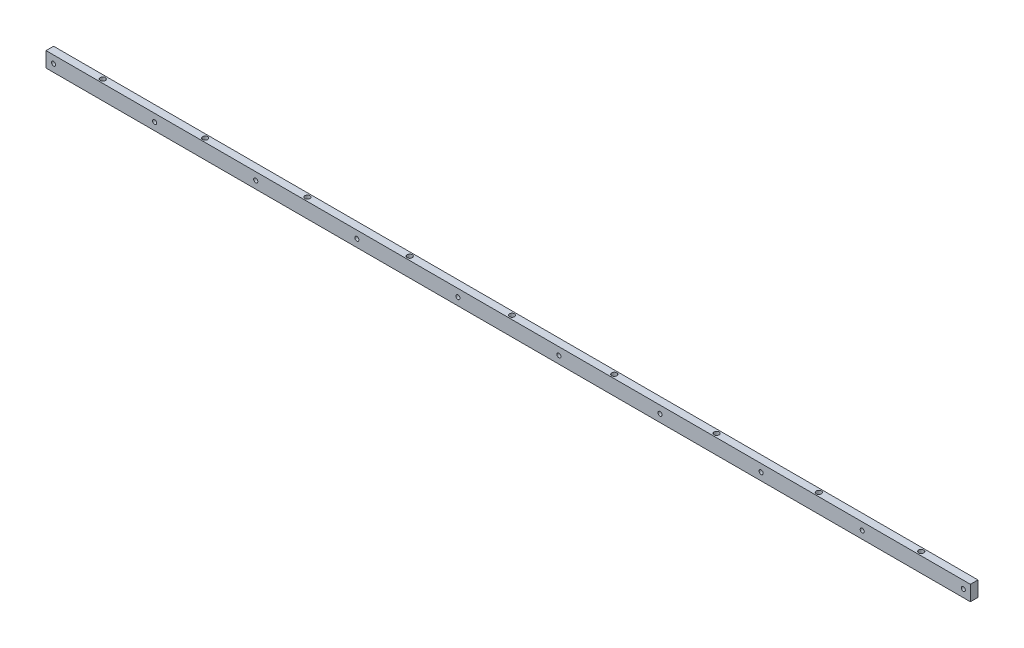
ISO-10303-21;
HEADER;
FILE_DESCRIPTION(('STEP AP214'),'2;1');
FILE_NAME('part.step','',(''),(''),'','','');
FILE_SCHEMA(('AUTOMOTIVE_DESIGN { 1 0 10303 214 1 1 1 1 }'));
ENDSEC;
DATA;
#1=APPLICATION_CONTEXT('core data for automotive mechanical design processes');
#2=APPLICATION_PROTOCOL_DEFINITION('international standard','automotive_design',2000,#1);
#3=PRODUCT_CONTEXT('',#1,'mechanical');
#4=PRODUCT('Part','Part','',(#3));
#5=PRODUCT_RELATED_PRODUCT_CATEGORY('part','',(#4));
#6=PRODUCT_DEFINITION_FORMATION('','',#4);
#7=PRODUCT_DEFINITION_CONTEXT('part definition',#1,'design');
#8=PRODUCT_DEFINITION('design','',#6,#7);
#9=PRODUCT_DEFINITION_SHAPE('','',#8);
#10=(LENGTH_UNIT() NAMED_UNIT(*) SI_UNIT(.MILLI.,.METRE.));
#11=(NAMED_UNIT(*) PLANE_ANGLE_UNIT() SI_UNIT($,.RADIAN.));
#12=(NAMED_UNIT(*) SI_UNIT($,.STERADIAN.) SOLID_ANGLE_UNIT());
#13=UNCERTAINTY_MEASURE_WITH_UNIT(LENGTH_MEASURE(1.E-05),#10,'distance_accuracy_value','');
#14=(GEOMETRIC_REPRESENTATION_CONTEXT(3) GLOBAL_UNCERTAINTY_ASSIGNED_CONTEXT((#13)) GLOBAL_UNIT_ASSIGNED_CONTEXT((#10,
#11,#12)) REPRESENTATION_CONTEXT('',''));
#15=CARTESIAN_POINT('',(0.,0.,0.));
#16=DIRECTION('',(0.,0.,1.));
#17=DIRECTION('',(1.,0.,0.));
#18=AXIS2_PLACEMENT_3D('',#15,#16,#17);
#19=CARTESIAN_POINT('',(0.,0.,-12.7));
#20=DIRECTION('',(-1.,0.,0.));
#21=DIRECTION('',(0.,0.,1.));
#22=AXIS2_PLACEMENT_3D('',#19,#20,#21);
#23=PLANE('',#22);
#24=DIRECTION('',(0.,-1.,0.));
#25=VECTOR('',#24,1.);
#26=CARTESIAN_POINT('',(0.,0.,0.));
#27=LINE('',#26,#25);
#28=CARTESIAN_POINT('',(0.,25.4,0.));
#29=VERTEX_POINT('',#28);
#30=CARTESIAN_POINT('',(0.,0.,0.));
#31=VERTEX_POINT('',#30);
#32=EDGE_CURVE('E105',#29,#31,#27,.T.);
#33=ORIENTED_EDGE('',*,*,#32,.F.);
#34=DIRECTION('',(0.,0.,1.));
#35=VECTOR('',#34,1.);
#36=CARTESIAN_POINT('',(0.,25.4,-12.7));
#37=LINE('',#36,#35);
#38=CARTESIAN_POINT('',(0.,25.4,-12.7));
#39=VERTEX_POINT('',#38);
#40=EDGE_CURVE('E11',#39,#29,#37,.T.);
#41=ORIENTED_EDGE('',*,*,#40,.F.);
#42=DIRECTION('',(0.,-1.,0.));
#43=VECTOR('',#42,1.);
#44=CARTESIAN_POINT('',(0.,0.,-12.7));
#45=LINE('',#44,#43);
#46=CARTESIAN_POINT('',(0.,0.,-12.7));
#47=VERTEX_POINT('',#46);
#48=EDGE_CURVE('E98',#39,#47,#45,.T.);
#49=ORIENTED_EDGE('',*,*,#48,.T.);
#50=DIRECTION('',(0.,0.,1.));
#51=VECTOR('',#50,1.);
#52=CARTESIAN_POINT('',(0.,0.,-12.7));
#53=LINE('',#52,#51);
#54=EDGE_CURVE('E43',#47,#31,#53,.T.);
#55=ORIENTED_EDGE('',*,*,#54,.T.);
#56=EDGE_LOOP('',(#33,#41,#49,#55));
#57=FACE_BOUND('',#56,.T.);
#58=ADVANCED_FACE('F40',(#57),#23,.T.);
#59=CARTESIAN_POINT('',(0.,25.4,-12.7));
#60=DIRECTION('',(0.,1.,0.));
#61=DIRECTION('',(0.,0.,1.));
#62=AXIS2_PLACEMENT_3D('',#59,#60,#61);
#63=PLANE('',#62);
#64=CARTESIAN_POINT('',(1460.5,25.4,-6.35));
#65=DIRECTION('',(0.,1.,0.));
#66=DIRECTION('',(0.,0.,1.));
#67=AXIS2_PLACEMENT_3D('',#64,#65,#66);
#68=CIRCLE('',#67,4.31800000000004);
#69=CARTESIAN_POINT('',(1460.5,25.4,-2.03199999999996));
#70=VERTEX_POINT('',#69);
#71=EDGE_CURVE('E417',#70,#70,#68,.T.);
#72=ORIENTED_EDGE('',*,*,#71,.F.);
#73=EDGE_LOOP('',(#72));
#74=FACE_BOUND('',#73,.T.);
#75=CARTESIAN_POINT('',(1289.05,25.4,-6.35));
#76=DIRECTION('',(0.,1.,0.));
#77=DIRECTION('',(0.,0.,1.));
#78=AXIS2_PLACEMENT_3D('',#75,#76,#77);
#79=CIRCLE('',#78,4.31800000000004);
#80=CARTESIAN_POINT('',(1289.05,25.4,-2.03199999999996));
#81=VERTEX_POINT('',#80);
#82=EDGE_CURVE('E425',#81,#81,#79,.T.);
#83=ORIENTED_EDGE('',*,*,#82,.F.);
#84=EDGE_LOOP('',(#83));
#85=FACE_BOUND('',#84,.T.);
#86=CARTESIAN_POINT('',(1117.6,25.4,-6.35));
#87=DIRECTION('',(0.,1.,0.));
#88=DIRECTION('',(0.,0.,1.));
#89=AXIS2_PLACEMENT_3D('',#86,#87,#88);
#90=CIRCLE('',#89,4.31800000000004);
#91=CARTESIAN_POINT('',(1117.6,25.4,-2.03199999999996));
#92=VERTEX_POINT('',#91);
#93=EDGE_CURVE('E435',#92,#92,#90,.T.);
#94=ORIENTED_EDGE('',*,*,#93,.F.);
#95=EDGE_LOOP('',(#94));
#96=FACE_BOUND('',#95,.T.);
#97=CARTESIAN_POINT('',(946.15,25.4,-6.35));
#98=DIRECTION('',(0.,1.,0.));
#99=DIRECTION('',(0.,0.,1.));
#100=AXIS2_PLACEMENT_3D('',#97,#98,#99);
#101=CIRCLE('',#100,4.31800000000004);
#102=CARTESIAN_POINT('',(946.15,25.4,-2.03199999999996));
#103=VERTEX_POINT('',#102);
#104=EDGE_CURVE('E445',#103,#103,#101,.T.);
#105=ORIENTED_EDGE('',*,*,#104,.F.);
#106=EDGE_LOOP('',(#105));
#107=FACE_BOUND('',#106,.T.);
#108=CARTESIAN_POINT('',(774.7,25.4,-6.35));
#109=DIRECTION('',(0.,1.,0.));
#110=DIRECTION('',(0.,0.,1.));
#111=AXIS2_PLACEMENT_3D('',#108,#109,#110);
#112=CIRCLE('',#111,4.31800000000004);
#113=CARTESIAN_POINT('',(774.7,25.4,-2.03199999999996));
#114=VERTEX_POINT('',#113);
#115=EDGE_CURVE('E455',#114,#114,#112,.T.);
#116=ORIENTED_EDGE('',*,*,#115,.F.);
#117=EDGE_LOOP('',(#116));
#118=FACE_BOUND('',#117,.T.);
#119=CARTESIAN_POINT('',(603.25,25.4,-6.35));
#120=DIRECTION('',(0.,1.,0.));
#121=DIRECTION('',(0.,0.,1.));
#122=AXIS2_PLACEMENT_3D('',#119,#120,#121);
#123=CIRCLE('',#122,4.31800000000004);
#124=CARTESIAN_POINT('',(603.25,25.4,-2.03199999999996));
#125=VERTEX_POINT('',#124);
#126=EDGE_CURVE('E465',#125,#125,#123,.T.);
#127=ORIENTED_EDGE('',*,*,#126,.F.);
#128=EDGE_LOOP('',(#127));
#129=FACE_BOUND('',#128,.T.);
#130=CARTESIAN_POINT('',(431.8,25.4,-6.35));
#131=DIRECTION('',(0.,1.,0.));
#132=DIRECTION('',(0.,0.,1.));
#133=AXIS2_PLACEMENT_3D('',#130,#131,#132);
#134=CIRCLE('',#133,4.31799999999999);
#135=CARTESIAN_POINT('',(431.8,25.4,-2.03200000000001));
#136=VERTEX_POINT('',#135);
#137=EDGE_CURVE('E475',#136,#136,#134,.T.);
#138=ORIENTED_EDGE('',*,*,#137,.F.);
#139=EDGE_LOOP('',(#138));
#140=FACE_BOUND('',#139,.T.);
#141=CARTESIAN_POINT('',(260.35,25.4,-6.35));
#142=DIRECTION('',(0.,1.,0.));
#143=DIRECTION('',(0.,0.,1.));
#144=AXIS2_PLACEMENT_3D('',#141,#142,#143);
#145=CIRCLE('',#144,4.31799999999999);
#146=CARTESIAN_POINT('',(260.35,25.4,-2.03200000000001));
#147=VERTEX_POINT('',#146);
#148=EDGE_CURVE('E485',#147,#147,#145,.T.);
#149=ORIENTED_EDGE('',*,*,#148,.F.);
#150=EDGE_LOOP('',(#149));
#151=FACE_BOUND('',#150,.T.);
#152=CARTESIAN_POINT('',(88.9,25.4,-6.35));
#153=DIRECTION('',(0.,1.,0.));
#154=DIRECTION('',(0.,0.,1.));
#155=AXIS2_PLACEMENT_3D('',#152,#153,#154);
#156=CIRCLE('',#155,4.31800000000002);
#157=CARTESIAN_POINT('',(88.9,25.4,-2.03199999999998));
#158=VERTEX_POINT('',#157);
#159=EDGE_CURVE('E495',#158,#158,#156,.T.);
#160=ORIENTED_EDGE('',*,*,#159,.F.);
#161=EDGE_LOOP('',(#160));
#162=FACE_BOUND('',#161,.T.);
#163=DIRECTION('',(-1.,0.,0.));
#164=VECTOR('',#163,1.);
#165=CARTESIAN_POINT('',(0.,25.4,0.));
#166=LINE('',#165,#164);
#167=CARTESIAN_POINT('',(1549.4,25.4,0.));
#168=VERTEX_POINT('',#167);
#169=EDGE_CURVE('E100',#168,#29,#166,.T.);
#170=ORIENTED_EDGE('',*,*,#169,.F.);
#171=DIRECTION('',(0.,0.,1.));
#172=VECTOR('',#171,1.);
#173=CARTESIAN_POINT('',(1549.4,25.4,-12.7));
#174=LINE('',#173,#172);
#175=CARTESIAN_POINT('',(1549.4,25.4,-12.7));
#176=VERTEX_POINT('',#175);
#177=EDGE_CURVE('E49',#176,#168,#174,.T.);
#178=ORIENTED_EDGE('',*,*,#177,.F.);
#179=DIRECTION('',(-1.,0.,0.));
#180=VECTOR('',#179,1.);
#181=CARTESIAN_POINT('',(0.,25.4,-12.7));
#182=LINE('',#181,#180);
#183=EDGE_CURVE('E95',#176,#39,#182,.T.);
#184=ORIENTED_EDGE('',*,*,#183,.T.);
#185=ORIENTED_EDGE('',*,*,#40,.T.);
#186=EDGE_LOOP('',(#170,#178,#184,#185));
#187=FACE_BOUND('',#186,.T.);
#188=ADVANCED_FACE('F116',(#74,#85,#96,#107,#118,#129,#140,#151,#162,#187),#63,.T.);
#189=CARTESIAN_POINT('',(1549.4,0.,-12.7));
#190=DIRECTION('',(1.,0.,0.));
#191=DIRECTION('',(0.,0.,-1.));
#192=AXIS2_PLACEMENT_3D('',#189,#190,#191);
#193=PLANE('',#192);
#194=DIRECTION('',(0.,1.,0.));
#195=VECTOR('',#194,1.);
#196=CARTESIAN_POINT('',(1549.4,0.,0.));
#197=LINE('',#196,#195);
#198=CARTESIAN_POINT('',(1549.4,0.,0.));
#199=VERTEX_POINT('',#198);
#200=EDGE_CURVE('E90',#199,#168,#197,.T.);
#201=ORIENTED_EDGE('',*,*,#200,.F.);
#202=DIRECTION('',(0.,0.,1.));
#203=VECTOR('',#202,1.);
#204=CARTESIAN_POINT('',(1549.4,0.,-12.7));
#205=LINE('',#204,#203);
#206=CARTESIAN_POINT('',(1549.4,0.,-12.7));
#207=VERTEX_POINT('',#206);
#208=EDGE_CURVE('E85',#207,#199,#205,.T.);
#209=ORIENTED_EDGE('',*,*,#208,.F.);
#210=DIRECTION('',(0.,1.,0.));
#211=VECTOR('',#210,1.);
#212=CARTESIAN_POINT('',(1549.4,0.,-12.7));
#213=LINE('',#212,#211);
#214=EDGE_CURVE('E88',#207,#176,#213,.T.);
#215=ORIENTED_EDGE('',*,*,#214,.T.);
#216=ORIENTED_EDGE('',*,*,#177,.T.);
#217=EDGE_LOOP('',(#201,#209,#215,#216));
#218=FACE_BOUND('',#217,.T.);
#219=ADVANCED_FACE('F87',(#218),#193,.T.);
#220=CARTESIAN_POINT('',(0.,0.,-12.7));
#221=DIRECTION('',(0.,-1.,0.));
#222=DIRECTION('',(0.,0.,-1.));
#223=AXIS2_PLACEMENT_3D('',#220,#221,#222);
#224=PLANE('',#223);
#225=CARTESIAN_POINT('',(1460.5,0.,-6.35));
#226=DIRECTION('',(0.,1.,0.));
#227=DIRECTION('',(0.,0.,1.));
#228=AXIS2_PLACEMENT_3D('',#225,#226,#227);
#229=CIRCLE('',#228,2.79399999999996);
#230=CARTESIAN_POINT('',(1460.5,0.,-3.55600000000004));
#231=VERTEX_POINT('',#230);
#232=EDGE_CURVE('E138',#231,#231,#229,.T.);
#233=ORIENTED_EDGE('',*,*,#232,.T.);
#234=EDGE_LOOP('',(#233));
#235=FACE_BOUND('',#234,.T.);
#236=CARTESIAN_POINT('',(1289.05,0.,-6.35));
#237=DIRECTION('',(0.,1.,0.));
#238=DIRECTION('',(0.,0.,1.));
#239=AXIS2_PLACEMENT_3D('',#236,#237,#238);
#240=CIRCLE('',#239,2.79399999999996);
#241=CARTESIAN_POINT('',(1289.05,0.,-3.55600000000004));
#242=VERTEX_POINT('',#241);
#243=EDGE_CURVE('E142',#242,#242,#240,.T.);
#244=ORIENTED_EDGE('',*,*,#243,.T.);
#245=EDGE_LOOP('',(#244));
#246=FACE_BOUND('',#245,.T.);
#247=CARTESIAN_POINT('',(1117.6,0.,-6.35));
#248=DIRECTION('',(0.,1.,0.));
#249=DIRECTION('',(0.,0.,1.));
#250=AXIS2_PLACEMENT_3D('',#247,#248,#249);
#251=CIRCLE('',#250,2.79399999999996);
#252=CARTESIAN_POINT('',(1117.6,0.,-3.55600000000004));
#253=VERTEX_POINT('',#252);
#254=EDGE_CURVE('E146',#253,#253,#251,.T.);
#255=ORIENTED_EDGE('',*,*,#254,.T.);
#256=EDGE_LOOP('',(#255));
#257=FACE_BOUND('',#256,.T.);
#258=CARTESIAN_POINT('',(946.15,0.,-6.35));
#259=DIRECTION('',(0.,1.,0.));
#260=DIRECTION('',(0.,0.,1.));
#261=AXIS2_PLACEMENT_3D('',#258,#259,#260);
#262=CIRCLE('',#261,2.79399999999996);
#263=CARTESIAN_POINT('',(946.15,0.,-3.55600000000004));
#264=VERTEX_POINT('',#263);
#265=EDGE_CURVE('E150',#264,#264,#262,.T.);
#266=ORIENTED_EDGE('',*,*,#265,.T.);
#267=EDGE_LOOP('',(#266));
#268=FACE_BOUND('',#267,.T.);
#269=CARTESIAN_POINT('',(774.7,0.,-6.35));
#270=DIRECTION('',(0.,1.,0.));
#271=DIRECTION('',(0.,0.,1.));
#272=AXIS2_PLACEMENT_3D('',#269,#270,#271);
#273=CIRCLE('',#272,2.79399999999996);
#274=CARTESIAN_POINT('',(774.7,0.,-3.55600000000004));
#275=VERTEX_POINT('',#274);
#276=EDGE_CURVE('E154',#275,#275,#273,.T.);
#277=ORIENTED_EDGE('',*,*,#276,.T.);
#278=EDGE_LOOP('',(#277));
#279=FACE_BOUND('',#278,.T.);
#280=CARTESIAN_POINT('',(603.25,0.,-6.35));
#281=DIRECTION('',(0.,1.,0.));
#282=DIRECTION('',(0.,0.,1.));
#283=AXIS2_PLACEMENT_3D('',#280,#281,#282);
#284=CIRCLE('',#283,2.79399999999996);
#285=CARTESIAN_POINT('',(603.25,0.,-3.55600000000004));
#286=VERTEX_POINT('',#285);
#287=EDGE_CURVE('E158',#286,#286,#284,.T.);
#288=ORIENTED_EDGE('',*,*,#287,.T.);
#289=EDGE_LOOP('',(#288));
#290=FACE_BOUND('',#289,.T.);
#291=CARTESIAN_POINT('',(431.8,0.,-6.35));
#292=DIRECTION('',(0.,1.,0.));
#293=DIRECTION('',(0.,0.,1.));
#294=AXIS2_PLACEMENT_3D('',#291,#292,#293);
#295=CIRCLE('',#294,2.79400000000002);
#296=CARTESIAN_POINT('',(431.8,0.,-3.55599999999998));
#297=VERTEX_POINT('',#296);
#298=EDGE_CURVE('E162',#297,#297,#295,.T.);
#299=ORIENTED_EDGE('',*,*,#298,.T.);
#300=EDGE_LOOP('',(#299));
#301=FACE_BOUND('',#300,.T.);
#302=CARTESIAN_POINT('',(260.35,0.,-6.35));
#303=DIRECTION('',(0.,1.,0.));
#304=DIRECTION('',(0.,0.,1.));
#305=AXIS2_PLACEMENT_3D('',#302,#303,#304);
#306=CIRCLE('',#305,2.79400000000002);
#307=CARTESIAN_POINT('',(260.35,0.,-3.55599999999998));
#308=VERTEX_POINT('',#307);
#309=EDGE_CURVE('E166',#308,#308,#306,.T.);
#310=ORIENTED_EDGE('',*,*,#309,.T.);
#311=EDGE_LOOP('',(#310));
#312=FACE_BOUND('',#311,.T.);
#313=CARTESIAN_POINT('',(88.9,0.,-6.35));
#314=DIRECTION('',(0.,1.,0.));
#315=DIRECTION('',(0.,0.,1.));
#316=AXIS2_PLACEMENT_3D('',#313,#314,#315);
#317=CIRCLE('',#316,2.794);
#318=CARTESIAN_POINT('',(88.9,0.,-3.55599999999999));
#319=VERTEX_POINT('',#318);
#320=EDGE_CURVE('E169',#319,#319,#317,.T.);
#321=ORIENTED_EDGE('',*,*,#320,.T.);
#322=EDGE_LOOP('',(#321));
#323=FACE_BOUND('',#322,.T.);
#324=DIRECTION('',(1.,0.,0.));
#325=VECTOR('',#324,1.);
#326=CARTESIAN_POINT('',(0.,0.,0.));
#327=LINE('',#326,#325);
#328=EDGE_CURVE('E108',#31,#199,#327,.T.);
#329=ORIENTED_EDGE('',*,*,#328,.F.);
#330=ORIENTED_EDGE('',*,*,#54,.F.);
#331=DIRECTION('',(1.,0.,0.));
#332=VECTOR('',#331,1.);
#333=CARTESIAN_POINT('',(0.,0.,-12.7));
#334=LINE('',#333,#332);
#335=EDGE_CURVE('E94',#47,#207,#334,.T.);
#336=ORIENTED_EDGE('',*,*,#335,.T.);
#337=ORIENTED_EDGE('',*,*,#208,.T.);
#338=EDGE_LOOP('',(#329,#330,#336,#337));
#339=FACE_BOUND('',#338,.T.);
#340=ADVANCED_FACE('F97',(#235,#246,#257,#268,#279,#290,#301,#312,#323,#339),#224,.T.);
#341=CARTESIAN_POINT('',(0.,0.,-12.7));
#342=DIRECTION('',(0.,0.,-1.));
#343=DIRECTION('',(-1.,0.,0.));
#344=AXIS2_PLACEMENT_3D('',#341,#342,#343);
#345=PLANE('',#344);
#346=CARTESIAN_POINT('',(1537.462,12.7,-12.7));
#347=DIRECTION('',(0.,0.,1.));
#348=DIRECTION('',(1.,0.,0.));
#349=AXIS2_PLACEMENT_3D('',#346,#347,#348);
#350=CIRCLE('',#349,3.429);
#351=CARTESIAN_POINT('',(1540.891,12.7,-12.7));
#352=VERTEX_POINT('',#351);
#353=EDGE_CURVE('E175',#352,#352,#350,.T.);
#354=ORIENTED_EDGE('',*,*,#353,.T.);
#355=EDGE_LOOP('',(#354));
#356=FACE_BOUND('',#355,.T.);
#357=CARTESIAN_POINT('',(1368.044,12.7,-12.7));
#358=DIRECTION('',(0.,0.,1.));
#359=DIRECTION('',(1.,0.,0.));
#360=AXIS2_PLACEMENT_3D('',#357,#358,#359);
#361=CIRCLE('',#360,3.429);
#362=CARTESIAN_POINT('',(1371.473,12.7,-12.7));
#363=VERTEX_POINT('',#362);
#364=EDGE_CURVE('E185',#363,#363,#361,.T.);
#365=ORIENTED_EDGE('',*,*,#364,.T.);
#366=EDGE_LOOP('',(#365));
#367=FACE_BOUND('',#366,.T.);
#368=CARTESIAN_POINT('',(1198.626,12.7,-12.7));
#369=DIRECTION('',(0.,0.,1.));
#370=DIRECTION('',(1.,0.,0.));
#371=AXIS2_PLACEMENT_3D('',#368,#369,#370);
#372=CIRCLE('',#371,3.429);
#373=CARTESIAN_POINT('',(1202.055,12.7,-12.7));
#374=VERTEX_POINT('',#373);
#375=EDGE_CURVE('E191',#374,#374,#372,.T.);
#376=ORIENTED_EDGE('',*,*,#375,.T.);
#377=EDGE_LOOP('',(#376));
#378=FACE_BOUND('',#377,.T.);
#379=CARTESIAN_POINT('',(1029.208,12.7,-12.7));
#380=DIRECTION('',(0.,0.,1.));
#381=DIRECTION('',(1.,0.,0.));
#382=AXIS2_PLACEMENT_3D('',#379,#380,#381);
#383=CIRCLE('',#382,3.429);
#384=CARTESIAN_POINT('',(1032.637,12.7,-12.7));
#385=VERTEX_POINT('',#384);
#386=EDGE_CURVE('E197',#385,#385,#383,.T.);
#387=ORIENTED_EDGE('',*,*,#386,.T.);
#388=EDGE_LOOP('',(#387));
#389=FACE_BOUND('',#388,.T.);
#390=CARTESIAN_POINT('',(859.79,12.7,-12.7));
#391=DIRECTION('',(0.,0.,1.));
#392=DIRECTION('',(1.,0.,0.));
#393=AXIS2_PLACEMENT_3D('',#390,#391,#392);
#394=CIRCLE('',#393,3.429);
#395=CARTESIAN_POINT('',(863.219,12.7,-12.7));
#396=VERTEX_POINT('',#395);
#397=EDGE_CURVE('E203',#396,#396,#394,.T.);
#398=ORIENTED_EDGE('',*,*,#397,.T.);
#399=EDGE_LOOP('',(#398));
#400=FACE_BOUND('',#399,.T.);
#401=CARTESIAN_POINT('',(690.372,12.7,-12.7));
#402=DIRECTION('',(0.,0.,1.));
#403=DIRECTION('',(1.,0.,0.));
#404=AXIS2_PLACEMENT_3D('',#401,#402,#403);
#405=CIRCLE('',#404,3.429);
#406=CARTESIAN_POINT('',(693.801,12.7,-12.7));
#407=VERTEX_POINT('',#406);
#408=EDGE_CURVE('E209',#407,#407,#405,.T.);
#409=ORIENTED_EDGE('',*,*,#408,.T.);
#410=EDGE_LOOP('',(#409));
#411=FACE_BOUND('',#410,.T.);
#412=CARTESIAN_POINT('',(520.954,12.7,-12.7));
#413=DIRECTION('',(0.,0.,1.));
#414=DIRECTION('',(1.,0.,0.));
#415=AXIS2_PLACEMENT_3D('',#412,#413,#414);
#416=CIRCLE('',#415,3.429);
#417=CARTESIAN_POINT('',(524.383,12.7,-12.7));
#418=VERTEX_POINT('',#417);
#419=EDGE_CURVE('E215',#418,#418,#416,.T.);
#420=ORIENTED_EDGE('',*,*,#419,.T.);
#421=EDGE_LOOP('',(#420));
#422=FACE_BOUND('',#421,.T.);
#423=CARTESIAN_POINT('',(351.536,12.7,-12.7));
#424=DIRECTION('',(0.,0.,1.));
#425=DIRECTION('',(1.,0.,0.));
#426=AXIS2_PLACEMENT_3D('',#423,#424,#425);
#427=CIRCLE('',#426,3.429);
#428=CARTESIAN_POINT('',(354.965,12.7,-12.7));
#429=VERTEX_POINT('',#428);
#430=EDGE_CURVE('E221',#429,#429,#427,.T.);
#431=ORIENTED_EDGE('',*,*,#430,.T.);
#432=EDGE_LOOP('',(#431));
#433=FACE_BOUND('',#432,.T.);
#434=CARTESIAN_POINT('',(182.118,12.7,-12.7));
#435=DIRECTION('',(0.,0.,1.));
#436=DIRECTION('',(1.,0.,0.));
#437=AXIS2_PLACEMENT_3D('',#434,#435,#436);
#438=CIRCLE('',#437,3.42900000000003);
#439=CARTESIAN_POINT('',(185.547,12.7,-12.7));
#440=VERTEX_POINT('',#439);
#441=EDGE_CURVE('E227',#440,#440,#438,.T.);
#442=ORIENTED_EDGE('',*,*,#441,.T.);
#443=EDGE_LOOP('',(#442));
#444=FACE_BOUND('',#443,.T.);
#445=CARTESIAN_POINT('',(12.7,12.7,-12.7));
#446=DIRECTION('',(0.,0.,1.));
#447=DIRECTION('',(1.,0.,0.));
#448=AXIS2_PLACEMENT_3D('',#445,#446,#447);
#449=CIRCLE('',#448,3.429);
#450=CARTESIAN_POINT('',(16.129,12.7,-12.7));
#451=VERTEX_POINT('',#450);
#452=EDGE_CURVE('E109',#451,#451,#449,.T.);
#453=ORIENTED_EDGE('',*,*,#452,.T.);
#454=EDGE_LOOP('',(#453));
#455=FACE_BOUND('',#454,.T.);
#456=ORIENTED_EDGE('',*,*,#48,.F.);
#457=ORIENTED_EDGE('',*,*,#183,.F.);
#458=ORIENTED_EDGE('',*,*,#214,.F.);
#459=ORIENTED_EDGE('',*,*,#335,.F.);
#460=EDGE_LOOP('',(#456,#457,#458,#459));
#461=FACE_BOUND('',#460,.T.);
#462=ADVANCED_FACE('F93',(#356,#367,#378,#389,#400,#411,#422,#433,#444,#455,#461),#345,.T.);
#463=CARTESIAN_POINT('',(0.,0.,0.));
#464=DIRECTION('',(0.,0.,-1.));
#465=DIRECTION('',(-1.,0.,0.));
#466=AXIS2_PLACEMENT_3D('',#463,#464,#465);
#467=PLANE('',#466);
#468=CARTESIAN_POINT('',(1537.462,12.7,0.));
#469=DIRECTION('',(0.,0.,1.));
#470=DIRECTION('',(1.,0.,0.));
#471=AXIS2_PLACEMENT_3D('',#468,#469,#470);
#472=CIRCLE('',#471,3.429);
#473=CARTESIAN_POINT('',(1540.891,12.7,0.));
#474=VERTEX_POINT('',#473);
#475=EDGE_CURVE('E171',#474,#474,#472,.T.);
#476=ORIENTED_EDGE('',*,*,#475,.F.);
#477=EDGE_LOOP('',(#476));
#478=FACE_BOUND('',#477,.T.);
#479=CARTESIAN_POINT('',(1368.044,12.7,0.));
#480=DIRECTION('',(0.,0.,1.));
#481=DIRECTION('',(1.,0.,0.));
#482=AXIS2_PLACEMENT_3D('',#479,#480,#481);
#483=CIRCLE('',#482,3.429);
#484=CARTESIAN_POINT('',(1371.473,12.7,0.));
#485=VERTEX_POINT('',#484);
#486=EDGE_CURVE('E183',#485,#485,#483,.T.);
#487=ORIENTED_EDGE('',*,*,#486,.F.);
#488=EDGE_LOOP('',(#487));
#489=FACE_BOUND('',#488,.T.);
#490=CARTESIAN_POINT('',(1198.626,12.7,0.));
#491=DIRECTION('',(0.,0.,1.));
#492=DIRECTION('',(1.,0.,0.));
#493=AXIS2_PLACEMENT_3D('',#490,#491,#492);
#494=CIRCLE('',#493,3.429);
#495=CARTESIAN_POINT('',(1202.055,12.7,0.));
#496=VERTEX_POINT('',#495);
#497=EDGE_CURVE('E188',#496,#496,#494,.T.);
#498=ORIENTED_EDGE('',*,*,#497,.F.);
#499=EDGE_LOOP('',(#498));
#500=FACE_BOUND('',#499,.T.);
#501=CARTESIAN_POINT('',(1029.208,12.7,0.));
#502=DIRECTION('',(0.,0.,1.));
#503=DIRECTION('',(1.,0.,0.));
#504=AXIS2_PLACEMENT_3D('',#501,#502,#503);
#505=CIRCLE('',#504,3.429);
#506=CARTESIAN_POINT('',(1032.637,12.7,0.));
#507=VERTEX_POINT('',#506);
#508=EDGE_CURVE('E194',#507,#507,#505,.T.);
#509=ORIENTED_EDGE('',*,*,#508,.F.);
#510=EDGE_LOOP('',(#509));
#511=FACE_BOUND('',#510,.T.);
#512=CARTESIAN_POINT('',(859.79,12.7,0.));
#513=DIRECTION('',(0.,0.,1.));
#514=DIRECTION('',(1.,0.,0.));
#515=AXIS2_PLACEMENT_3D('',#512,#513,#514);
#516=CIRCLE('',#515,3.429);
#517=CARTESIAN_POINT('',(863.219,12.7,0.));
#518=VERTEX_POINT('',#517);
#519=EDGE_CURVE('E200',#518,#518,#516,.T.);
#520=ORIENTED_EDGE('',*,*,#519,.F.);
#521=EDGE_LOOP('',(#520));
#522=FACE_BOUND('',#521,.T.);
#523=CARTESIAN_POINT('',(690.372,12.7,0.));
#524=DIRECTION('',(0.,0.,1.));
#525=DIRECTION('',(1.,0.,0.));
#526=AXIS2_PLACEMENT_3D('',#523,#524,#525);
#527=CIRCLE('',#526,3.429);
#528=CARTESIAN_POINT('',(693.801,12.7,0.));
#529=VERTEX_POINT('',#528);
#530=EDGE_CURVE('E206',#529,#529,#527,.T.);
#531=ORIENTED_EDGE('',*,*,#530,.F.);
#532=EDGE_LOOP('',(#531));
#533=FACE_BOUND('',#532,.T.);
#534=CARTESIAN_POINT('',(520.954,12.7,0.));
#535=DIRECTION('',(0.,0.,1.));
#536=DIRECTION('',(1.,0.,0.));
#537=AXIS2_PLACEMENT_3D('',#534,#535,#536);
#538=CIRCLE('',#537,3.429);
#539=CARTESIAN_POINT('',(524.383,12.7,0.));
#540=VERTEX_POINT('',#539);
#541=EDGE_CURVE('E212',#540,#540,#538,.T.);
#542=ORIENTED_EDGE('',*,*,#541,.F.);
#543=EDGE_LOOP('',(#542));
#544=FACE_BOUND('',#543,.T.);
#545=CARTESIAN_POINT('',(351.536,12.7,0.));
#546=DIRECTION('',(0.,0.,1.));
#547=DIRECTION('',(1.,0.,0.));
#548=AXIS2_PLACEMENT_3D('',#545,#546,#547);
#549=CIRCLE('',#548,3.429);
#550=CARTESIAN_POINT('',(354.965,12.7,0.));
#551=VERTEX_POINT('',#550);
#552=EDGE_CURVE('E218',#551,#551,#549,.T.);
#553=ORIENTED_EDGE('',*,*,#552,.F.);
#554=EDGE_LOOP('',(#553));
#555=FACE_BOUND('',#554,.T.);
#556=CARTESIAN_POINT('',(182.118,12.7,0.));
#557=DIRECTION('',(0.,0.,1.));
#558=DIRECTION('',(1.,0.,0.));
#559=AXIS2_PLACEMENT_3D('',#556,#557,#558);
#560=CIRCLE('',#559,3.42900000000003);
#561=CARTESIAN_POINT('',(185.547,12.7,0.));
#562=VERTEX_POINT('',#561);
#563=EDGE_CURVE('E224',#562,#562,#560,.T.);
#564=ORIENTED_EDGE('',*,*,#563,.F.);
#565=EDGE_LOOP('',(#564));
#566=FACE_BOUND('',#565,.T.);
#567=CARTESIAN_POINT('',(12.7,12.7,0.));
#568=DIRECTION('',(0.,0.,1.));
#569=DIRECTION('',(1.,0.,0.));
#570=AXIS2_PLACEMENT_3D('',#567,#568,#569);
#571=CIRCLE('',#570,3.429);
#572=CARTESIAN_POINT('',(16.129,12.7,0.));
#573=VERTEX_POINT('',#572);
#574=EDGE_CURVE('E230',#573,#573,#571,.T.);
#575=ORIENTED_EDGE('',*,*,#574,.F.);
#576=EDGE_LOOP('',(#575));
#577=FACE_BOUND('',#576,.T.);
#578=ORIENTED_EDGE('',*,*,#32,.T.);
#579=ORIENTED_EDGE('',*,*,#328,.T.);
#580=ORIENTED_EDGE('',*,*,#200,.T.);
#581=ORIENTED_EDGE('',*,*,#169,.T.);
#582=EDGE_LOOP('',(#578,#579,#580,#581));
#583=FACE_BOUND('',#582,.T.);
#584=ADVANCED_FACE('F115',(#478,#489,#500,#511,#522,#533,#544,#555,#566,#577,#583),#467,.F.);
#585=CARTESIAN_POINT('',(12.7,12.7,-12.7));
#586=DIRECTION('',(0.,0.,1.));
#587=DIRECTION('',(1.,0.,0.));
#588=AXIS2_PLACEMENT_3D('',#585,#586,#587);
#589=CYLINDRICAL_SURFACE('',#588,3.429);
#590=ORIENTED_EDGE('',*,*,#452,.F.);
#591=EDGE_LOOP('',(#590));
#592=FACE_BOUND('',#591,.T.);
#593=ORIENTED_EDGE('',*,*,#574,.T.);
#594=EDGE_LOOP('',(#593));
#595=FACE_BOUND('',#594,.T.);
#596=ADVANCED_FACE('F237',(#592,#595),#589,.F.);
#597=CARTESIAN_POINT('',(182.118,12.7,-12.7));
#598=DIRECTION('',(0.,0.,1.));
#599=DIRECTION('',(1.,0.,0.));
#600=AXIS2_PLACEMENT_3D('',#597,#598,#599);
#601=CYLINDRICAL_SURFACE('',#600,3.42900000000003);
#602=ORIENTED_EDGE('',*,*,#441,.F.);
#603=EDGE_LOOP('',(#602));
#604=FACE_BOUND('',#603,.T.);
#605=ORIENTED_EDGE('',*,*,#563,.T.);
#606=EDGE_LOOP('',(#605));
#607=FACE_BOUND('',#606,.T.);
#608=ADVANCED_FACE('F244',(#604,#607),#601,.F.);
#609=CARTESIAN_POINT('',(351.536,12.7,-12.7));
#610=DIRECTION('',(0.,0.,1.));
#611=DIRECTION('',(1.,0.,0.));
#612=AXIS2_PLACEMENT_3D('',#609,#610,#611);
#613=CYLINDRICAL_SURFACE('',#612,3.429);
#614=ORIENTED_EDGE('',*,*,#430,.F.);
#615=EDGE_LOOP('',(#614));
#616=FACE_BOUND('',#615,.T.);
#617=ORIENTED_EDGE('',*,*,#552,.T.);
#618=EDGE_LOOP('',(#617));
#619=FACE_BOUND('',#618,.T.);
#620=ADVANCED_FACE('F266',(#616,#619),#613,.F.);
#621=CARTESIAN_POINT('',(520.954,12.7,-12.7));
#622=DIRECTION('',(0.,0.,1.));
#623=DIRECTION('',(1.,0.,0.));
#624=AXIS2_PLACEMENT_3D('',#621,#622,#623);
#625=CYLINDRICAL_SURFACE('',#624,3.429);
#626=ORIENTED_EDGE('',*,*,#419,.F.);
#627=EDGE_LOOP('',(#626));
#628=FACE_BOUND('',#627,.T.);
#629=ORIENTED_EDGE('',*,*,#541,.T.);
#630=EDGE_LOOP('',(#629));
#631=FACE_BOUND('',#630,.T.);
#632=ADVANCED_FACE('F272',(#628,#631),#625,.F.);
#633=CARTESIAN_POINT('',(690.372,12.7,-12.7));
#634=DIRECTION('',(0.,0.,1.));
#635=DIRECTION('',(1.,0.,0.));
#636=AXIS2_PLACEMENT_3D('',#633,#634,#635);
#637=CYLINDRICAL_SURFACE('',#636,3.429);
#638=ORIENTED_EDGE('',*,*,#408,.F.);
#639=EDGE_LOOP('',(#638));
#640=FACE_BOUND('',#639,.T.);
#641=ORIENTED_EDGE('',*,*,#530,.T.);
#642=EDGE_LOOP('',(#641));
#643=FACE_BOUND('',#642,.T.);
#644=ADVANCED_FACE('F279',(#640,#643),#637,.F.);
#645=CARTESIAN_POINT('',(859.79,12.7,-12.7));
#646=DIRECTION('',(0.,0.,1.));
#647=DIRECTION('',(1.,0.,0.));
#648=AXIS2_PLACEMENT_3D('',#645,#646,#647);
#649=CYLINDRICAL_SURFACE('',#648,3.429);
#650=ORIENTED_EDGE('',*,*,#397,.F.);
#651=EDGE_LOOP('',(#650));
#652=FACE_BOUND('',#651,.T.);
#653=ORIENTED_EDGE('',*,*,#519,.T.);
#654=EDGE_LOOP('',(#653));
#655=FACE_BOUND('',#654,.T.);
#656=ADVANCED_FACE('F283',(#652,#655),#649,.F.);
#657=CARTESIAN_POINT('',(1029.208,12.7,-12.7));
#658=DIRECTION('',(0.,0.,1.));
#659=DIRECTION('',(1.,0.,0.));
#660=AXIS2_PLACEMENT_3D('',#657,#658,#659);
#661=CYLINDRICAL_SURFACE('',#660,3.429);
#662=ORIENTED_EDGE('',*,*,#386,.F.);
#663=EDGE_LOOP('',(#662));
#664=FACE_BOUND('',#663,.T.);
#665=ORIENTED_EDGE('',*,*,#508,.T.);
#666=EDGE_LOOP('',(#665));
#667=FACE_BOUND('',#666,.T.);
#668=ADVANCED_FACE('F287',(#664,#667),#661,.F.);
#669=CARTESIAN_POINT('',(1198.626,12.7,-12.7));
#670=DIRECTION('',(0.,0.,1.));
#671=DIRECTION('',(1.,0.,0.));
#672=AXIS2_PLACEMENT_3D('',#669,#670,#671);
#673=CYLINDRICAL_SURFACE('',#672,3.429);
#674=ORIENTED_EDGE('',*,*,#375,.F.);
#675=EDGE_LOOP('',(#674));
#676=FACE_BOUND('',#675,.T.);
#677=ORIENTED_EDGE('',*,*,#497,.T.);
#678=EDGE_LOOP('',(#677));
#679=FACE_BOUND('',#678,.T.);
#680=ADVANCED_FACE('F291',(#676,#679),#673,.F.);
#681=CARTESIAN_POINT('',(1368.044,12.7,-12.7));
#682=DIRECTION('',(0.,0.,1.));
#683=DIRECTION('',(1.,0.,0.));
#684=AXIS2_PLACEMENT_3D('',#681,#682,#683);
#685=CYLINDRICAL_SURFACE('',#684,3.429);
#686=ORIENTED_EDGE('',*,*,#364,.F.);
#687=EDGE_LOOP('',(#686));
#688=FACE_BOUND('',#687,.T.);
#689=ORIENTED_EDGE('',*,*,#486,.T.);
#690=EDGE_LOOP('',(#689));
#691=FACE_BOUND('',#690,.T.);
#692=ADVANCED_FACE('F295',(#688,#691),#685,.F.);
#693=CARTESIAN_POINT('',(1537.462,12.7,-12.7));
#694=DIRECTION('',(0.,0.,1.));
#695=DIRECTION('',(1.,0.,0.));
#696=AXIS2_PLACEMENT_3D('',#693,#694,#695);
#697=CYLINDRICAL_SURFACE('',#696,3.429);
#698=ORIENTED_EDGE('',*,*,#353,.F.);
#699=EDGE_LOOP('',(#698));
#700=FACE_BOUND('',#699,.T.);
#701=ORIENTED_EDGE('',*,*,#475,.T.);
#702=EDGE_LOOP('',(#701));
#703=FACE_BOUND('',#702,.T.);
#704=ADVANCED_FACE('F299',(#700,#703),#697,.F.);
#705=CARTESIAN_POINT('',(88.9,25.4,-6.35));
#706=DIRECTION('',(0.,1.,0.));
#707=DIRECTION('',(0.,0.,1.));
#708=AXIS2_PLACEMENT_3D('',#705,#706,#707);
#709=CYLINDRICAL_SURFACE('',#708,2.794);
#710=ORIENTED_EDGE('',*,*,#320,.F.);
#711=EDGE_LOOP('',(#710));
#712=FACE_BOUND('',#711,.T.);
#713=CARTESIAN_POINT('',(88.9,14.478,-6.35));
#714=DIRECTION('',(0.,1.,0.));
#715=DIRECTION('',(0.,0.,1.));
#716=AXIS2_PLACEMENT_3D('',#713,#714,#715);
#717=CIRCLE('',#716,2.794);
#718=CARTESIAN_POINT('',(88.9,14.478,-3.55599999999999));
#719=VERTEX_POINT('',#718);
#720=EDGE_CURVE('E172',#719,#719,#717,.T.);
#721=ORIENTED_EDGE('',*,*,#720,.T.);
#722=EDGE_LOOP('',(#721));
#723=FACE_BOUND('',#722,.T.);
#724=ADVANCED_FACE('F303',(#712,#723),#709,.F.);
#725=CARTESIAN_POINT('',(91.694,14.478,-6.35));
#726=DIRECTION('',(0.,-1.,0.));
#727=DIRECTION('',(0.,0.,-1.));
#728=AXIS2_PLACEMENT_3D('',#725,#726,#727);
#729=PLANE('',#728);
#730=ORIENTED_EDGE('',*,*,#720,.F.);
#731=EDGE_LOOP('',(#730));
#732=FACE_BOUND('',#731,.T.);
#733=CARTESIAN_POINT('',(88.9,14.478,-6.35));
#734=DIRECTION('',(0.,1.,0.));
#735=DIRECTION('',(0.,0.,1.));
#736=AXIS2_PLACEMENT_3D('',#733,#734,#735);
#737=CIRCLE('',#736,4.31800000000002);
#738=CARTESIAN_POINT('',(88.9,14.478,-2.03199999999998));
#739=VERTEX_POINT('',#738);
#740=EDGE_CURVE('E178',#739,#739,#737,.T.);
#741=ORIENTED_EDGE('',*,*,#740,.T.);
#742=EDGE_LOOP('',(#741));
#743=FACE_BOUND('',#742,.T.);
#744=ADVANCED_FACE('F307',(#732,#743),#729,.F.);
#745=CARTESIAN_POINT('',(88.9,25.4,-6.35));
#746=DIRECTION('',(0.,1.,0.));
#747=DIRECTION('',(0.,0.,1.));
#748=AXIS2_PLACEMENT_3D('',#745,#746,#747);
#749=CYLINDRICAL_SURFACE('',#748,4.31800000000002);
#750=ORIENTED_EDGE('',*,*,#740,.F.);
#751=EDGE_LOOP('',(#750));
#752=FACE_BOUND('',#751,.T.);
#753=ORIENTED_EDGE('',*,*,#159,.T.);
#754=EDGE_LOOP('',(#753));
#755=FACE_BOUND('',#754,.T.);
#756=ADVANCED_FACE('F310',(#752,#755),#749,.F.);
#757=CARTESIAN_POINT('',(260.35,25.4,-6.35));
#758=DIRECTION('',(0.,1.,0.));
#759=DIRECTION('',(0.,0.,1.));
#760=AXIS2_PLACEMENT_3D('',#757,#758,#759);
#761=CYLINDRICAL_SURFACE('',#760,2.79400000000002);
#762=ORIENTED_EDGE('',*,*,#309,.F.);
#763=EDGE_LOOP('',(#762));
#764=FACE_BOUND('',#763,.T.);
#765=CARTESIAN_POINT('',(260.35,14.478,-6.35));
#766=DIRECTION('',(0.,1.,0.));
#767=DIRECTION('',(0.,0.,1.));
#768=AXIS2_PLACEMENT_3D('',#765,#766,#767);
#769=CIRCLE('',#768,2.79400000000002);
#770=CARTESIAN_POINT('',(260.35,14.478,-3.55599999999998));
#771=VERTEX_POINT('',#770);
#772=EDGE_CURVE('E491',#771,#771,#769,.T.);
#773=ORIENTED_EDGE('',*,*,#772,.T.);
#774=EDGE_LOOP('',(#773));
#775=FACE_BOUND('',#774,.T.);
#776=ADVANCED_FACE('F314',(#764,#775),#761,.F.);
#777=CARTESIAN_POINT('',(263.144,14.478,-6.35));
#778=DIRECTION('',(0.,-1.,0.));
#779=DIRECTION('',(0.,0.,-1.));
#780=AXIS2_PLACEMENT_3D('',#777,#778,#779);
#781=PLANE('',#780);
#782=ORIENTED_EDGE('',*,*,#772,.F.);
#783=EDGE_LOOP('',(#782));
#784=FACE_BOUND('',#783,.T.);
#785=CARTESIAN_POINT('',(260.35,14.478,-6.35));
#786=DIRECTION('',(0.,1.,0.));
#787=DIRECTION('',(0.,0.,1.));
#788=AXIS2_PLACEMENT_3D('',#785,#786,#787);
#789=CIRCLE('',#788,4.31799999999999);
#790=CARTESIAN_POINT('',(260.35,14.478,-2.03200000000001));
#791=VERTEX_POINT('',#790);
#792=EDGE_CURVE('E488',#791,#791,#789,.T.);
#793=ORIENTED_EDGE('',*,*,#792,.T.);
#794=EDGE_LOOP('',(#793));
#795=FACE_BOUND('',#794,.T.);
#796=ADVANCED_FACE('F318',(#784,#795),#781,.F.);
#797=CARTESIAN_POINT('',(260.35,25.4,-6.35));
#798=DIRECTION('',(0.,1.,0.));
#799=DIRECTION('',(0.,0.,1.));
#800=AXIS2_PLACEMENT_3D('',#797,#798,#799);
#801=CYLINDRICAL_SURFACE('',#800,4.31799999999999);
#802=ORIENTED_EDGE('',*,*,#792,.F.);
#803=EDGE_LOOP('',(#802));
#804=FACE_BOUND('',#803,.T.);
#805=ORIENTED_EDGE('',*,*,#148,.T.);
#806=EDGE_LOOP('',(#805));
#807=FACE_BOUND('',#806,.T.);
#808=ADVANCED_FACE('F322',(#804,#807),#801,.F.);
#809=CARTESIAN_POINT('',(431.8,25.4,-6.35));
#810=DIRECTION('',(0.,1.,0.));
#811=DIRECTION('',(0.,0.,1.));
#812=AXIS2_PLACEMENT_3D('',#809,#810,#811);
#813=CYLINDRICAL_SURFACE('',#812,2.79400000000002);
#814=ORIENTED_EDGE('',*,*,#298,.F.);
#815=EDGE_LOOP('',(#814));
#816=FACE_BOUND('',#815,.T.);
#817=CARTESIAN_POINT('',(431.8,14.478,-6.35));
#818=DIRECTION('',(0.,1.,0.));
#819=DIRECTION('',(0.,0.,1.));
#820=AXIS2_PLACEMENT_3D('',#817,#818,#819);
#821=CIRCLE('',#820,2.79400000000002);
#822=CARTESIAN_POINT('',(431.8,14.478,-3.55599999999998));
#823=VERTEX_POINT('',#822);
#824=EDGE_CURVE('E481',#823,#823,#821,.T.);
#825=ORIENTED_EDGE('',*,*,#824,.T.);
#826=EDGE_LOOP('',(#825));
#827=FACE_BOUND('',#826,.T.);
#828=ADVANCED_FACE('F326',(#816,#827),#813,.F.);
#829=CARTESIAN_POINT('',(434.594,14.478,-6.35));
#830=DIRECTION('',(0.,-1.,0.));
#831=DIRECTION('',(0.,0.,-1.));
#832=AXIS2_PLACEMENT_3D('',#829,#830,#831);
#833=PLANE('',#832);
#834=ORIENTED_EDGE('',*,*,#824,.F.);
#835=EDGE_LOOP('',(#834));
#836=FACE_BOUND('',#835,.T.);
#837=CARTESIAN_POINT('',(431.8,14.478,-6.35));
#838=DIRECTION('',(0.,1.,0.));
#839=DIRECTION('',(0.,0.,1.));
#840=AXIS2_PLACEMENT_3D('',#837,#838,#839);
#841=CIRCLE('',#840,4.31799999999999);
#842=CARTESIAN_POINT('',(431.8,14.478,-2.03200000000001));
#843=VERTEX_POINT('',#842);
#844=EDGE_CURVE('E478',#843,#843,#841,.T.);
#845=ORIENTED_EDGE('',*,*,#844,.T.);
#846=EDGE_LOOP('',(#845));
#847=FACE_BOUND('',#846,.T.);
#848=ADVANCED_FACE('F330',(#836,#847),#833,.F.);
#849=CARTESIAN_POINT('',(431.8,25.4,-6.35));
#850=DIRECTION('',(0.,1.,0.));
#851=DIRECTION('',(0.,0.,1.));
#852=AXIS2_PLACEMENT_3D('',#849,#850,#851);
#853=CYLINDRICAL_SURFACE('',#852,4.31799999999999);
#854=ORIENTED_EDGE('',*,*,#844,.F.);
#855=EDGE_LOOP('',(#854));
#856=FACE_BOUND('',#855,.T.);
#857=ORIENTED_EDGE('',*,*,#137,.T.);
#858=EDGE_LOOP('',(#857));
#859=FACE_BOUND('',#858,.T.);
#860=ADVANCED_FACE('F334',(#856,#859),#853,.F.);
#861=CARTESIAN_POINT('',(603.25,25.4,-6.35));
#862=DIRECTION('',(0.,1.,0.));
#863=DIRECTION('',(0.,0.,1.));
#864=AXIS2_PLACEMENT_3D('',#861,#862,#863);
#865=CYLINDRICAL_SURFACE('',#864,2.79399999999996);
#866=CARTESIAN_POINT('',(603.25,14.478,-6.35));
#867=DIRECTION('',(0.,1.,0.));
#868=DIRECTION('',(0.,0.,1.));
#869=AXIS2_PLACEMENT_3D('',#866,#867,#868);
#870=CIRCLE('',#869,2.79399999999996);
#871=CARTESIAN_POINT('',(603.25,14.478,-3.55600000000004));
#872=VERTEX_POINT('',#871);
#873=EDGE_CURVE('E471',#872,#872,#870,.T.);
#874=ORIENTED_EDGE('',*,*,#873,.T.);
#875=EDGE_LOOP('',(#874));
#876=FACE_BOUND('',#875,.T.);
#877=ORIENTED_EDGE('',*,*,#287,.F.);
#878=EDGE_LOOP('',(#877));
#879=FACE_BOUND('',#878,.T.);
#880=ADVANCED_FACE('F338',(#876,#879),#865,.F.);
#881=CARTESIAN_POINT('',(606.044,14.478,-6.35));
#882=DIRECTION('',(0.,-1.,0.));
#883=DIRECTION('',(0.,0.,-1.));
#884=AXIS2_PLACEMENT_3D('',#881,#882,#883);
#885=PLANE('',#884);
#886=ORIENTED_EDGE('',*,*,#873,.F.);
#887=EDGE_LOOP('',(#886));
#888=FACE_BOUND('',#887,.T.);
#889=CARTESIAN_POINT('',(603.25,14.478,-6.35));
#890=DIRECTION('',(0.,1.,0.));
#891=DIRECTION('',(0.,0.,1.));
#892=AXIS2_PLACEMENT_3D('',#889,#890,#891);
#893=CIRCLE('',#892,4.31800000000004);
#894=CARTESIAN_POINT('',(603.25,14.478,-2.03199999999996));
#895=VERTEX_POINT('',#894);
#896=EDGE_CURVE('E468',#895,#895,#893,.T.);
#897=ORIENTED_EDGE('',*,*,#896,.T.);
#898=EDGE_LOOP('',(#897));
#899=FACE_BOUND('',#898,.T.);
#900=ADVANCED_FACE('F342',(#888,#899),#885,.F.);
#901=CARTESIAN_POINT('',(603.25,25.4,-6.35));
#902=DIRECTION('',(0.,1.,0.));
#903=DIRECTION('',(0.,0.,1.));
#904=AXIS2_PLACEMENT_3D('',#901,#902,#903);
#905=CYLINDRICAL_SURFACE('',#904,4.31800000000004);
#906=ORIENTED_EDGE('',*,*,#896,.F.);
#907=EDGE_LOOP('',(#906));
#908=FACE_BOUND('',#907,.T.);
#909=ORIENTED_EDGE('',*,*,#126,.T.);
#910=EDGE_LOOP('',(#909));
#911=FACE_BOUND('',#910,.T.);
#912=ADVANCED_FACE('F346',(#908,#911),#905,.F.);
#913=CARTESIAN_POINT('',(774.7,25.4,-6.35));
#914=DIRECTION('',(0.,1.,0.));
#915=DIRECTION('',(0.,0.,1.));
#916=AXIS2_PLACEMENT_3D('',#913,#914,#915);
#917=CYLINDRICAL_SURFACE('',#916,2.79399999999996);
#918=ORIENTED_EDGE('',*,*,#276,.F.);
#919=EDGE_LOOP('',(#918));
#920=FACE_BOUND('',#919,.T.);
#921=CARTESIAN_POINT('',(774.7,14.478,-6.35));
#922=DIRECTION('',(0.,1.,0.));
#923=DIRECTION('',(0.,0.,1.));
#924=AXIS2_PLACEMENT_3D('',#921,#922,#923);
#925=CIRCLE('',#924,2.79399999999996);
#926=CARTESIAN_POINT('',(774.7,14.478,-3.55600000000004));
#927=VERTEX_POINT('',#926);
#928=EDGE_CURVE('E461',#927,#927,#925,.T.);
#929=ORIENTED_EDGE('',*,*,#928,.T.);
#930=EDGE_LOOP('',(#929));
#931=FACE_BOUND('',#930,.T.);
#932=ADVANCED_FACE('F350',(#920,#931),#917,.F.);
#933=CARTESIAN_POINT('',(777.494,14.478,-6.35));
#934=DIRECTION('',(0.,-1.,0.));
#935=DIRECTION('',(0.,0.,-1.));
#936=AXIS2_PLACEMENT_3D('',#933,#934,#935);
#937=PLANE('',#936);
#938=ORIENTED_EDGE('',*,*,#928,.F.);
#939=EDGE_LOOP('',(#938));
#940=FACE_BOUND('',#939,.T.);
#941=CARTESIAN_POINT('',(774.7,14.478,-6.35));
#942=DIRECTION('',(0.,1.,0.));
#943=DIRECTION('',(0.,0.,1.));
#944=AXIS2_PLACEMENT_3D('',#941,#942,#943);
#945=CIRCLE('',#944,4.31800000000004);
#946=CARTESIAN_POINT('',(774.7,14.478,-2.03199999999996));
#947=VERTEX_POINT('',#946);
#948=EDGE_CURVE('E458',#947,#947,#945,.T.);
#949=ORIENTED_EDGE('',*,*,#948,.T.);
#950=EDGE_LOOP('',(#949));
#951=FACE_BOUND('',#950,.T.);
#952=ADVANCED_FACE('F354',(#940,#951),#937,.F.);
#953=CARTESIAN_POINT('',(774.7,25.4,-6.35));
#954=DIRECTION('',(0.,1.,0.));
#955=DIRECTION('',(0.,0.,1.));
#956=AXIS2_PLACEMENT_3D('',#953,#954,#955);
#957=CYLINDRICAL_SURFACE('',#956,4.31800000000004);
#958=ORIENTED_EDGE('',*,*,#948,.F.);
#959=EDGE_LOOP('',(#958));
#960=FACE_BOUND('',#959,.T.);
#961=ORIENTED_EDGE('',*,*,#115,.T.);
#962=EDGE_LOOP('',(#961));
#963=FACE_BOUND('',#962,.T.);
#964=ADVANCED_FACE('F358',(#960,#963),#957,.F.);
#965=CARTESIAN_POINT('',(946.15,25.4,-6.35));
#966=DIRECTION('',(0.,1.,0.));
#967=DIRECTION('',(0.,0.,1.));
#968=AXIS2_PLACEMENT_3D('',#965,#966,#967);
#969=CYLINDRICAL_SURFACE('',#968,2.79399999999996);
#970=ORIENTED_EDGE('',*,*,#265,.F.);
#971=EDGE_LOOP('',(#970));
#972=FACE_BOUND('',#971,.T.);
#973=CARTESIAN_POINT('',(946.15,14.478,-6.35));
#974=DIRECTION('',(0.,1.,0.));
#975=DIRECTION('',(0.,0.,1.));
#976=AXIS2_PLACEMENT_3D('',#973,#974,#975);
#977=CIRCLE('',#976,2.79399999999996);
#978=CARTESIAN_POINT('',(946.15,14.478,-3.55600000000004));
#979=VERTEX_POINT('',#978);
#980=EDGE_CURVE('E451',#979,#979,#977,.T.);
#981=ORIENTED_EDGE('',*,*,#980,.T.);
#982=EDGE_LOOP('',(#981));
#983=FACE_BOUND('',#982,.T.);
#984=ADVANCED_FACE('F362',(#972,#983),#969,.F.);
#985=CARTESIAN_POINT('',(948.944,14.478,-6.35));
#986=DIRECTION('',(0.,-1.,0.));
#987=DIRECTION('',(0.,0.,-1.));
#988=AXIS2_PLACEMENT_3D('',#985,#986,#987);
#989=PLANE('',#988);
#990=ORIENTED_EDGE('',*,*,#980,.F.);
#991=EDGE_LOOP('',(#990));
#992=FACE_BOUND('',#991,.T.);
#993=CARTESIAN_POINT('',(946.15,14.478,-6.35));
#994=DIRECTION('',(0.,1.,0.));
#995=DIRECTION('',(0.,0.,1.));
#996=AXIS2_PLACEMENT_3D('',#993,#994,#995);
#997=CIRCLE('',#996,4.31800000000004);
#998=CARTESIAN_POINT('',(946.15,14.478,-2.03199999999996));
#999=VERTEX_POINT('',#998);
#1000=EDGE_CURVE('E448',#999,#999,#997,.T.);
#1001=ORIENTED_EDGE('',*,*,#1000,.T.);
#1002=EDGE_LOOP('',(#1001));
#1003=FACE_BOUND('',#1002,.T.);
#1004=ADVANCED_FACE('F366',(#992,#1003),#989,.F.);
#1005=CARTESIAN_POINT('',(946.15,25.4,-6.35));
#1006=DIRECTION('',(0.,1.,0.));
#1007=DIRECTION('',(0.,0.,1.));
#1008=AXIS2_PLACEMENT_3D('',#1005,#1006,#1007);
#1009=CYLINDRICAL_SURFACE('',#1008,4.31800000000004);
#1010=ORIENTED_EDGE('',*,*,#1000,.F.);
#1011=EDGE_LOOP('',(#1010));
#1012=FACE_BOUND('',#1011,.T.);
#1013=ORIENTED_EDGE('',*,*,#104,.T.);
#1014=EDGE_LOOP('',(#1013));
#1015=FACE_BOUND('',#1014,.T.);
#1016=ADVANCED_FACE('F370',(#1012,#1015),#1009,.F.);
#1017=CARTESIAN_POINT('',(1117.6,25.4,-6.35));
#1018=DIRECTION('',(0.,1.,0.));
#1019=DIRECTION('',(0.,0.,1.));
#1020=AXIS2_PLACEMENT_3D('',#1017,#1018,#1019);
#1021=CYLINDRICAL_SURFACE('',#1020,2.79399999999996);
#1022=CARTESIAN_POINT('',(1117.6,14.478,-6.35));
#1023=DIRECTION('',(0.,1.,0.));
#1024=DIRECTION('',(0.,0.,1.));
#1025=AXIS2_PLACEMENT_3D('',#1022,#1023,#1024);
#1026=CIRCLE('',#1025,2.79399999999996);
#1027=CARTESIAN_POINT('',(1117.6,14.478,-3.55600000000004));
#1028=VERTEX_POINT('',#1027);
#1029=EDGE_CURVE('E441',#1028,#1028,#1026,.T.);
#1030=ORIENTED_EDGE('',*,*,#1029,.T.);
#1031=EDGE_LOOP('',(#1030));
#1032=FACE_BOUND('',#1031,.T.);
#1033=ORIENTED_EDGE('',*,*,#254,.F.);
#1034=EDGE_LOOP('',(#1033));
#1035=FACE_BOUND('',#1034,.T.);
#1036=ADVANCED_FACE('F374',(#1032,#1035),#1021,.F.);
#1037=CARTESIAN_POINT('',(1120.394,14.478,-6.35));
#1038=DIRECTION('',(0.,-1.,0.));
#1039=DIRECTION('',(0.,0.,-1.));
#1040=AXIS2_PLACEMENT_3D('',#1037,#1038,#1039);
#1041=PLANE('',#1040);
#1042=ORIENTED_EDGE('',*,*,#1029,.F.);
#1043=EDGE_LOOP('',(#1042));
#1044=FACE_BOUND('',#1043,.T.);
#1045=CARTESIAN_POINT('',(1117.6,14.478,-6.35));
#1046=DIRECTION('',(0.,1.,0.));
#1047=DIRECTION('',(0.,0.,1.));
#1048=AXIS2_PLACEMENT_3D('',#1045,#1046,#1047);
#1049=CIRCLE('',#1048,4.31800000000004);
#1050=CARTESIAN_POINT('',(1117.6,14.478,-2.03199999999996));
#1051=VERTEX_POINT('',#1050);
#1052=EDGE_CURVE('E438',#1051,#1051,#1049,.T.);
#1053=ORIENTED_EDGE('',*,*,#1052,.T.);
#1054=EDGE_LOOP('',(#1053));
#1055=FACE_BOUND('',#1054,.T.);
#1056=ADVANCED_FACE('F378',(#1044,#1055),#1041,.F.);
#1057=CARTESIAN_POINT('',(1117.6,25.4,-6.35));
#1058=DIRECTION('',(0.,1.,0.));
#1059=DIRECTION('',(0.,0.,1.));
#1060=AXIS2_PLACEMENT_3D('',#1057,#1058,#1059);
#1061=CYLINDRICAL_SURFACE('',#1060,4.31800000000004);
#1062=ORIENTED_EDGE('',*,*,#1052,.F.);
#1063=EDGE_LOOP('',(#1062));
#1064=FACE_BOUND('',#1063,.T.);
#1065=ORIENTED_EDGE('',*,*,#93,.T.);
#1066=EDGE_LOOP('',(#1065));
#1067=FACE_BOUND('',#1066,.T.);
#1068=ADVANCED_FACE('F382',(#1064,#1067),#1061,.F.);
#1069=CARTESIAN_POINT('',(1289.05,25.4,-6.35));
#1070=DIRECTION('',(0.,1.,0.));
#1071=DIRECTION('',(0.,0.,1.));
#1072=AXIS2_PLACEMENT_3D('',#1069,#1070,#1071);
#1073=CYLINDRICAL_SURFACE('',#1072,2.79399999999996);
#1074=ORIENTED_EDGE('',*,*,#243,.F.);
#1075=EDGE_LOOP('',(#1074));
#1076=FACE_BOUND('',#1075,.T.);
#1077=CARTESIAN_POINT('',(1289.05,14.478,-6.35));
#1078=DIRECTION('',(0.,1.,0.));
#1079=DIRECTION('',(0.,0.,1.));
#1080=AXIS2_PLACEMENT_3D('',#1077,#1078,#1079);
#1081=CIRCLE('',#1080,2.79399999999996);
#1082=CARTESIAN_POINT('',(1289.05,14.478,-3.55600000000004));
#1083=VERTEX_POINT('',#1082);
#1084=EDGE_CURVE('E431',#1083,#1083,#1081,.T.);
#1085=ORIENTED_EDGE('',*,*,#1084,.T.);
#1086=EDGE_LOOP('',(#1085));
#1087=FACE_BOUND('',#1086,.T.);
#1088=ADVANCED_FACE('F386',(#1076,#1087),#1073,.F.);
#1089=CARTESIAN_POINT('',(1291.844,14.478,-6.35));
#1090=DIRECTION('',(0.,-1.,0.));
#1091=DIRECTION('',(0.,0.,-1.));
#1092=AXIS2_PLACEMENT_3D('',#1089,#1090,#1091);
#1093=PLANE('',#1092);
#1094=ORIENTED_EDGE('',*,*,#1084,.F.);
#1095=EDGE_LOOP('',(#1094));
#1096=FACE_BOUND('',#1095,.T.);
#1097=CARTESIAN_POINT('',(1289.05,14.478,-6.35));
#1098=DIRECTION('',(0.,1.,0.));
#1099=DIRECTION('',(0.,0.,1.));
#1100=AXIS2_PLACEMENT_3D('',#1097,#1098,#1099);
#1101=CIRCLE('',#1100,4.31800000000004);
#1102=CARTESIAN_POINT('',(1289.05,14.478,-2.03199999999996));
#1103=VERTEX_POINT('',#1102);
#1104=EDGE_CURVE('E428',#1103,#1103,#1101,.T.);
#1105=ORIENTED_EDGE('',*,*,#1104,.T.);
#1106=EDGE_LOOP('',(#1105));
#1107=FACE_BOUND('',#1106,.T.);
#1108=ADVANCED_FACE('F390',(#1096,#1107),#1093,.F.);
#1109=CARTESIAN_POINT('',(1289.05,25.4,-6.35));
#1110=DIRECTION('',(0.,1.,0.));
#1111=DIRECTION('',(0.,0.,1.));
#1112=AXIS2_PLACEMENT_3D('',#1109,#1110,#1111);
#1113=CYLINDRICAL_SURFACE('',#1112,4.31800000000004);
#1114=ORIENTED_EDGE('',*,*,#1104,.F.);
#1115=EDGE_LOOP('',(#1114));
#1116=FACE_BOUND('',#1115,.T.);
#1117=ORIENTED_EDGE('',*,*,#82,.T.);
#1118=EDGE_LOOP('',(#1117));
#1119=FACE_BOUND('',#1118,.T.);
#1120=ADVANCED_FACE('F394',(#1116,#1119),#1113,.F.);
#1121=CARTESIAN_POINT('',(1460.5,25.4,-6.35));
#1122=DIRECTION('',(0.,1.,0.));
#1123=DIRECTION('',(0.,0.,1.));
#1124=AXIS2_PLACEMENT_3D('',#1121,#1122,#1123);
#1125=CYLINDRICAL_SURFACE('',#1124,2.79399999999996);
#1126=CARTESIAN_POINT('',(1460.5,14.478,-6.35));
#1127=DIRECTION('',(0.,1.,0.));
#1128=DIRECTION('',(0.,0.,1.));
#1129=AXIS2_PLACEMENT_3D('',#1126,#1127,#1128);
#1130=CIRCLE('',#1129,2.79399999999996);
#1131=CARTESIAN_POINT('',(1460.5,14.478,-3.55600000000004));
#1132=VERTEX_POINT('',#1131);
#1133=EDGE_CURVE('E419',#1132,#1132,#1130,.T.);
#1134=ORIENTED_EDGE('',*,*,#1133,.T.);
#1135=EDGE_LOOP('',(#1134));
#1136=FACE_BOUND('',#1135,.T.);
#1137=ORIENTED_EDGE('',*,*,#232,.F.);
#1138=EDGE_LOOP('',(#1137));
#1139=FACE_BOUND('',#1138,.T.);
#1140=ADVANCED_FACE('F398',(#1136,#1139),#1125,.F.);
#1141=CARTESIAN_POINT('',(1463.294,14.478,-6.35));
#1142=DIRECTION('',(0.,-1.,0.));
#1143=DIRECTION('',(0.,0.,-1.));
#1144=AXIS2_PLACEMENT_3D('',#1141,#1142,#1143);
#1145=PLANE('',#1144);
#1146=ORIENTED_EDGE('',*,*,#1133,.F.);
#1147=EDGE_LOOP('',(#1146));
#1148=FACE_BOUND('',#1147,.T.);
#1149=CARTESIAN_POINT('',(1460.5,14.478,-6.35));
#1150=DIRECTION('',(0.,1.,0.));
#1151=DIRECTION('',(0.,0.,1.));
#1152=AXIS2_PLACEMENT_3D('',#1149,#1150,#1151);
#1153=CIRCLE('',#1152,4.31800000000004);
#1154=CARTESIAN_POINT('',(1460.5,14.478,-2.03199999999996));
#1155=VERTEX_POINT('',#1154);
#1156=EDGE_CURVE('E415',#1155,#1155,#1153,.T.);
#1157=ORIENTED_EDGE('',*,*,#1156,.T.);
#1158=EDGE_LOOP('',(#1157));
#1159=FACE_BOUND('',#1158,.T.);
#1160=ADVANCED_FACE('F402',(#1148,#1159),#1145,.F.);
#1161=CARTESIAN_POINT('',(1460.5,25.4,-6.35));
#1162=DIRECTION('',(0.,1.,0.));
#1163=DIRECTION('',(0.,0.,1.));
#1164=AXIS2_PLACEMENT_3D('',#1161,#1162,#1163);
#1165=CYLINDRICAL_SURFACE('',#1164,4.31800000000004);
#1166=ORIENTED_EDGE('',*,*,#1156,.F.);
#1167=EDGE_LOOP('',(#1166));
#1168=FACE_BOUND('',#1167,.T.);
#1169=ORIENTED_EDGE('',*,*,#71,.T.);
#1170=EDGE_LOOP('',(#1169));
#1171=FACE_BOUND('',#1170,.T.);
#1172=ADVANCED_FACE('F406',(#1168,#1171),#1165,.F.);
#1173=CLOSED_SHELL('',(#58,#188,#219,#340,#462,#584,#596,#608,#620,#632,#644,#656,#668,#680,
#692,#704,#724,#744,#756,#776,#796,#808,#828,#848,#860,#880,#900,#912,#932,#952,#964,#984,#1004,
#1016,#1036,#1056,#1068,#1088,#1108,#1120,#1140,#1160,#1172));
#1174=MANIFOLD_SOLID_BREP('B2',#1173);
#1175=ADVANCED_BREP_SHAPE_REPRESENTATION('',(#18,#1174),#14);
#1176=SHAPE_DEFINITION_REPRESENTATION(#9,#1175);
ENDSEC;
END-ISO-10303-21;
